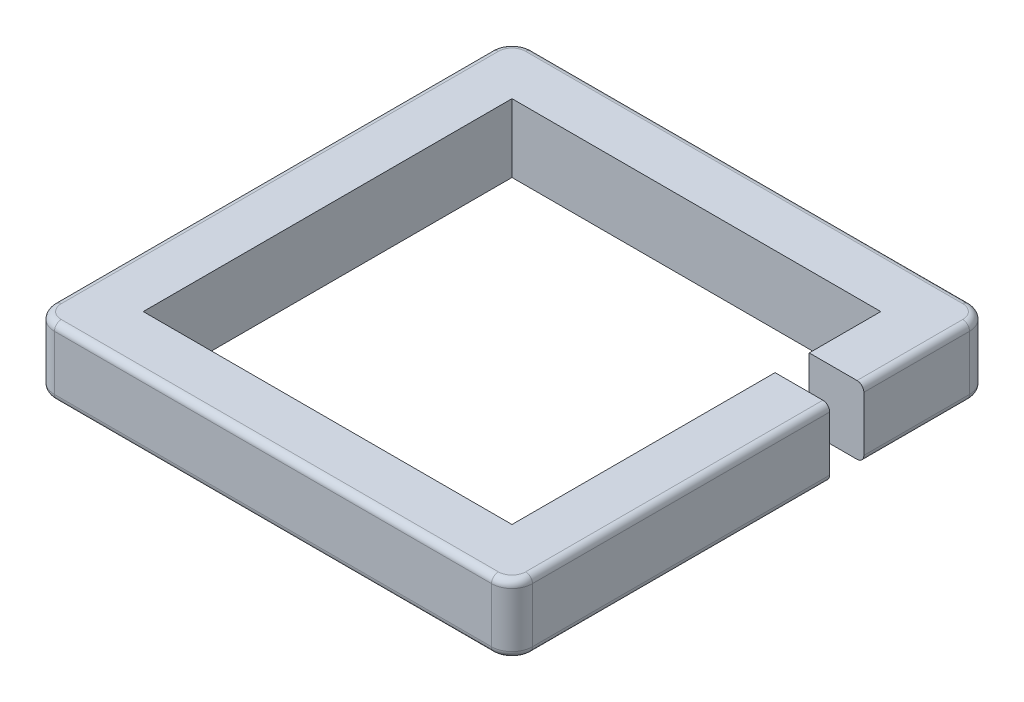
ISO-10303-21;
HEADER;
FILE_DESCRIPTION(('STEP AP214'),'2;1');
FILE_NAME('part.step','',(''),(''),'','','');
FILE_SCHEMA(('AUTOMOTIVE_DESIGN { 1 0 10303 214 1 1 1 1 }'));
ENDSEC;
DATA;
#1=APPLICATION_CONTEXT('core data for automotive mechanical design processes');
#2=APPLICATION_PROTOCOL_DEFINITION('international standard','automotive_design',2000,#1);
#3=PRODUCT_CONTEXT('',#1,'mechanical');
#4=PRODUCT('Part','Part','',(#3));
#5=PRODUCT_RELATED_PRODUCT_CATEGORY('part','',(#4));
#6=PRODUCT_DEFINITION_FORMATION('','',#4);
#7=PRODUCT_DEFINITION_CONTEXT('part definition',#1,'design');
#8=PRODUCT_DEFINITION('design','',#6,#7);
#9=PRODUCT_DEFINITION_SHAPE('','',#8);
#10=(LENGTH_UNIT() NAMED_UNIT(*) SI_UNIT(.MILLI.,.METRE.));
#11=(NAMED_UNIT(*) PLANE_ANGLE_UNIT() SI_UNIT($,.RADIAN.));
#12=(NAMED_UNIT(*) SI_UNIT($,.STERADIAN.) SOLID_ANGLE_UNIT());
#13=UNCERTAINTY_MEASURE_WITH_UNIT(LENGTH_MEASURE(1.E-05),#10,'distance_accuracy_value','');
#14=(GEOMETRIC_REPRESENTATION_CONTEXT(3) GLOBAL_UNCERTAINTY_ASSIGNED_CONTEXT((#13)) GLOBAL_UNIT_ASSIGNED_CONTEXT((#10,
#11,#12)) REPRESENTATION_CONTEXT('',''));
#15=CARTESIAN_POINT('',(0.,0.,0.));
#16=DIRECTION('',(0.,0.,1.));
#17=DIRECTION('',(1.,0.,0.));
#18=AXIS2_PLACEMENT_3D('',#15,#16,#17);
#19=CARTESIAN_POINT('',(444.5,127.,-444.5));
#20=DIRECTION('',(-1.,0.,0.));
#21=DIRECTION('',(0.,0.,1.));
#22=AXIS2_PLACEMENT_3D('',#19,#20,#21);
#23=PLANE('',#22);
#24=DIRECTION('',(0.,0.,-1.));
#25=VECTOR('',#24,1.);
#26=CARTESIAN_POINT('',(444.5,114.3,-444.5));
#27=LINE('',#26,#25);
#28=CARTESIAN_POINT('',(444.5,114.3,-406.4));
#29=VERTEX_POINT('',#28);
#30=CARTESIAN_POINT('',(444.5,114.3,-209.804000000003));
#31=VERTEX_POINT('',#30);
#32=EDGE_CURVE('E361',#29,#31,#27,.F.);
#33=ORIENTED_EDGE('',*,*,#32,.T.);
#34=DIRECTION('',(0.,1.,0.));
#35=VECTOR('',#34,1.);
#36=CARTESIAN_POINT('',(444.5,0.,-209.804000000003));
#37=LINE('',#36,#35);
#38=CARTESIAN_POINT('',(444.5,12.7,-209.804000000003));
#39=VERTEX_POINT('',#38);
#40=EDGE_CURVE('E61',#39,#31,#37,.T.);
#41=ORIENTED_EDGE('',*,*,#40,.F.);
#42=DIRECTION('',(0.,0.,-1.));
#43=VECTOR('',#42,1.);
#44=CARTESIAN_POINT('',(444.5,12.7,-406.4));
#45=LINE('',#44,#43);
#46=CARTESIAN_POINT('',(444.5,12.7,-406.4));
#47=VERTEX_POINT('',#46);
#48=EDGE_CURVE('E364',#39,#47,#45,.T.);
#49=ORIENTED_EDGE('',*,*,#48,.T.);
#50=DIRECTION('',(0.,-1.,0.));
#51=VECTOR('',#50,1.);
#52=CARTESIAN_POINT('',(444.5,127.,-406.4));
#53=LINE('',#52,#51);
#54=EDGE_CURVE('E283',#47,#29,#53,.F.);
#55=ORIENTED_EDGE('',*,*,#54,.T.);
#56=EDGE_LOOP('',(#33,#41,#49,#55));
#57=FACE_BOUND('',#56,.T.);
#58=ADVANCED_FACE('F47',(#57),#23,.F.);
#59=CARTESIAN_POINT('',(342.9,127.,-342.9));
#60=DIRECTION('',(-1.,0.,0.));
#61=DIRECTION('',(0.,0.,1.));
#62=AXIS2_PLACEMENT_3D('',#59,#60,#61);
#63=PLANE('',#62);
#64=DIRECTION('',(0.,1.,0.));
#65=VECTOR('',#64,1.);
#66=CARTESIAN_POINT('',(342.9,0.,-209.804000000003));
#67=LINE('',#66,#65);
#68=CARTESIAN_POINT('',(342.9,0.,-209.804000000003));
#69=VERTEX_POINT('',#68);
#70=CARTESIAN_POINT('',(342.9,127.,-209.804000000003));
#71=VERTEX_POINT('',#70);
#72=EDGE_CURVE('E447',#69,#71,#67,.T.);
#73=ORIENTED_EDGE('',*,*,#72,.T.);
#74=DIRECTION('',(0.,0.,-1.));
#75=VECTOR('',#74,1.);
#76=CARTESIAN_POINT('',(342.9,127.,-342.9));
#77=LINE('',#76,#75);
#78=CARTESIAN_POINT('',(342.9,127.,-342.9));
#79=VERTEX_POINT('',#78);
#80=EDGE_CURVE('E258',#71,#79,#77,.T.);
#81=ORIENTED_EDGE('',*,*,#80,.T.);
#82=DIRECTION('',(0.,-1.,0.));
#83=VECTOR('',#82,1.);
#84=CARTESIAN_POINT('',(342.9,127.,-342.9));
#85=LINE('',#84,#83);
#86=CARTESIAN_POINT('',(342.9,0.,-342.9));
#87=VERTEX_POINT('',#86);
#88=EDGE_CURVE('E265',#79,#87,#85,.T.);
#89=ORIENTED_EDGE('',*,*,#88,.T.);
#90=DIRECTION('',(0.,0.,-1.));
#91=VECTOR('',#90,1.);
#92=CARTESIAN_POINT('',(342.9,0.,-342.9));
#93=LINE('',#92,#91);
#94=EDGE_CURVE('E246',#69,#87,#93,.T.);
#95=ORIENTED_EDGE('',*,*,#94,.F.);
#96=EDGE_LOOP('',(#73,#81,#89,#95));
#97=FACE_BOUND('',#96,.T.);
#98=ADVANCED_FACE('F475',(#97),#63,.T.);
#99=CARTESIAN_POINT('',(431.8,12.7,-444.5));
#100=DIRECTION('',(0.,0.,1.));
#101=DIRECTION('',(1.,0.,0.));
#102=AXIS2_PLACEMENT_3D('',#99,#100,#101);
#103=CYLINDRICAL_SURFACE('',#102,12.7);
#104=CARTESIAN_POINT('',(431.8,12.7,-209.804000000003));
#105=DIRECTION('',(0.,0.,-1.));
#106=DIRECTION('',(-1.,0.,0.));
#107=AXIS2_PLACEMENT_3D('',#104,#105,#106);
#108=CIRCLE('',#107,12.7);
#109=CARTESIAN_POINT('',(431.8,0.,-209.804000000003));
#110=VERTEX_POINT('',#109);
#111=EDGE_CURVE('E393',#110,#39,#108,.F.);
#112=ORIENTED_EDGE('',*,*,#111,.F.);
#113=DIRECTION('',(0.,0.,-1.));
#114=VECTOR('',#113,1.);
#115=CARTESIAN_POINT('',(431.8,0.,406.4));
#116=LINE('',#115,#114);
#117=CARTESIAN_POINT('',(431.8,0.,-406.4));
#118=VERTEX_POINT('',#117);
#119=EDGE_CURVE('E293',#118,#110,#116,.F.);
#120=ORIENTED_EDGE('',*,*,#119,.F.);
#121=CARTESIAN_POINT('',(431.8,12.7,-406.4));
#122=DIRECTION('',(0.,0.,1.));
#123=DIRECTION('',(1.,0.,0.));
#124=AXIS2_PLACEMENT_3D('',#121,#122,#123);
#125=CIRCLE('',#124,12.7);
#126=EDGE_CURVE('E376',#118,#47,#125,.T.);
#127=ORIENTED_EDGE('',*,*,#126,.T.);
#128=ORIENTED_EDGE('',*,*,#48,.F.);
#129=EDGE_LOOP('',(#112,#120,#127,#128));
#130=FACE_BOUND('',#129,.T.);
#131=ADVANCED_FACE('F528',(#130),#103,.T.);
#132=CARTESIAN_POINT('',(431.8,114.3,0.));
#133=DIRECTION('',(0.,0.,-1.));
#134=DIRECTION('',(-1.,0.,0.));
#135=AXIS2_PLACEMENT_3D('',#132,#133,#134);
#136=CYLINDRICAL_SURFACE('',#135,12.7);
#137=CARTESIAN_POINT('',(431.8,114.3,-209.804000000003));
#138=DIRECTION('',(0.,0.,-1.));
#139=DIRECTION('',(-1.,0.,0.));
#140=AXIS2_PLACEMENT_3D('',#137,#138,#139);
#141=CIRCLE('',#140,12.7);
#142=CARTESIAN_POINT('',(431.8,127.,-209.804000000003));
#143=VERTEX_POINT('',#142);
#144=EDGE_CURVE('E11',#31,#143,#141,.F.);
#145=ORIENTED_EDGE('',*,*,#144,.F.);
#146=ORIENTED_EDGE('',*,*,#32,.F.);
#147=CARTESIAN_POINT('',(431.8,114.3,-406.4));
#148=DIRECTION('',(0.,0.,1.));
#149=DIRECTION('',(1.,0.,0.));
#150=AXIS2_PLACEMENT_3D('',#147,#148,#149);
#151=CIRCLE('',#150,12.7);
#152=CARTESIAN_POINT('',(431.8,127.,-406.4));
#153=VERTEX_POINT('',#152);
#154=EDGE_CURVE('E395',#29,#153,#151,.T.);
#155=ORIENTED_EDGE('',*,*,#154,.T.);
#156=DIRECTION('',(0.,0.,-1.));
#157=VECTOR('',#156,1.);
#158=CARTESIAN_POINT('',(431.8,127.,0.));
#159=LINE('',#158,#157);
#160=EDGE_CURVE('E341',#143,#153,#159,.T.);
#161=ORIENTED_EDGE('',*,*,#160,.F.);
#162=EDGE_LOOP('',(#145,#146,#155,#161));
#163=FACE_BOUND('',#162,.T.);
#164=ADVANCED_FACE('F484',(#163),#136,.T.);
#165=CARTESIAN_POINT('',(0.,127.,0.));
#166=DIRECTION('',(0.,-1.,0.));
#167=DIRECTION('',(0.,0.,-1.));
#168=AXIS2_PLACEMENT_3D('',#165,#166,#167);
#169=PLANE('',#168);
#170=ORIENTED_EDGE('',*,*,#80,.F.);
#171=DIRECTION('',(-1.,0.,0.));
#172=VECTOR('',#171,1.);
#173=CARTESIAN_POINT('',(342.9,127.,-209.804000000003));
#174=LINE('',#173,#172);
#175=EDGE_CURVE('E227',#143,#71,#174,.T.);
#176=ORIENTED_EDGE('',*,*,#175,.F.);
#177=ORIENTED_EDGE('',*,*,#160,.T.);
#178=CARTESIAN_POINT('',(406.4,127.,-406.4));
#179=DIRECTION('',(0.,-1.,0.));
#180=DIRECTION('',(0.,0.,-1.));
#181=AXIS2_PLACEMENT_3D('',#178,#179,#180);
#182=CIRCLE('',#181,25.4);
#183=CARTESIAN_POINT('',(406.4,127.,-431.8));
#184=VERTEX_POINT('',#183);
#185=EDGE_CURVE('E345',#153,#184,#182,.F.);
#186=ORIENTED_EDGE('',*,*,#185,.T.);
#187=DIRECTION('',(-1.,0.,0.));
#188=VECTOR('',#187,1.);
#189=CARTESIAN_POINT('',(0.,127.,-431.8));
#190=LINE('',#189,#188);
#191=CARTESIAN_POINT('',(-406.4,127.,-431.8));
#192=VERTEX_POINT('',#191);
#193=EDGE_CURVE('E347',#184,#192,#190,.T.);
#194=ORIENTED_EDGE('',*,*,#193,.T.);
#195=CARTESIAN_POINT('',(-406.4,127.,-406.4));
#196=DIRECTION('',(0.,-1.,0.));
#197=DIRECTION('',(0.,0.,-1.));
#198=AXIS2_PLACEMENT_3D('',#195,#196,#197);
#199=CIRCLE('',#198,25.4);
#200=CARTESIAN_POINT('',(-431.8,127.,-406.4));
#201=VERTEX_POINT('',#200);
#202=EDGE_CURVE('E349',#192,#201,#199,.F.);
#203=ORIENTED_EDGE('',*,*,#202,.T.);
#204=DIRECTION('',(0.,0.,1.));
#205=VECTOR('',#204,1.);
#206=CARTESIAN_POINT('',(-431.8,127.,0.));
#207=LINE('',#206,#205);
#208=CARTESIAN_POINT('',(-431.8,127.,406.4));
#209=VERTEX_POINT('',#208);
#210=EDGE_CURVE('E351',#201,#209,#207,.T.);
#211=ORIENTED_EDGE('',*,*,#210,.T.);
#212=CARTESIAN_POINT('',(-406.4,127.,406.4));
#213=DIRECTION('',(0.,-1.,0.));
#214=DIRECTION('',(0.,0.,-1.));
#215=AXIS2_PLACEMENT_3D('',#212,#213,#214);
#216=CIRCLE('',#215,25.4);
#217=CARTESIAN_POINT('',(-406.4,127.,431.8));
#218=VERTEX_POINT('',#217);
#219=EDGE_CURVE('E353',#209,#218,#216,.F.);
#220=ORIENTED_EDGE('',*,*,#219,.T.);
#221=DIRECTION('',(1.,0.,0.));
#222=VECTOR('',#221,1.);
#223=CARTESIAN_POINT('',(0.,127.,431.8));
#224=LINE('',#223,#222);
#225=CARTESIAN_POINT('',(406.4,127.,431.8));
#226=VERTEX_POINT('',#225);
#227=EDGE_CURVE('E355',#218,#226,#224,.T.);
#228=ORIENTED_EDGE('',*,*,#227,.T.);
#229=CARTESIAN_POINT('',(406.4,127.,406.4));
#230=DIRECTION('',(0.,-1.,0.));
#231=DIRECTION('',(0.,0.,-1.));
#232=AXIS2_PLACEMENT_3D('',#229,#230,#231);
#233=CIRCLE('',#232,25.4);
#234=CARTESIAN_POINT('',(431.8,127.,406.4));
#235=VERTEX_POINT('',#234);
#236=EDGE_CURVE('E357',#226,#235,#233,.F.);
#237=ORIENTED_EDGE('',*,*,#236,.T.);
#238=CARTESIAN_POINT('',(431.8,127.,-146.304000000003));
#239=VERTEX_POINT('',#238);
#240=EDGE_CURVE('E342',#235,#239,#159,.T.);
#241=ORIENTED_EDGE('',*,*,#240,.T.);
#242=DIRECTION('',(1.,0.,0.));
#243=VECTOR('',#242,1.);
#244=CARTESIAN_POINT('',(342.9,127.,-146.304000000003));
#245=LINE('',#244,#243);
#246=CARTESIAN_POINT('',(342.9,127.,-146.304000000003));
#247=VERTEX_POINT('',#246);
#248=EDGE_CURVE('E69',#247,#239,#245,.T.);
#249=ORIENTED_EDGE('',*,*,#248,.F.);
#250=CARTESIAN_POINT('',(342.9,127.,342.9));
#251=VERTEX_POINT('',#250);
#252=EDGE_CURVE('E236',#251,#247,#77,.T.);
#253=ORIENTED_EDGE('',*,*,#252,.F.);
#254=DIRECTION('',(1.,0.,0.));
#255=VECTOR('',#254,1.);
#256=CARTESIAN_POINT('',(-342.9,127.,342.9));
#257=LINE('',#256,#255);
#258=CARTESIAN_POINT('',(-342.9,127.,342.9));
#259=VERTEX_POINT('',#258);
#260=EDGE_CURVE('E253',#259,#251,#257,.T.);
#261=ORIENTED_EDGE('',*,*,#260,.F.);
#262=DIRECTION('',(0.,0.,1.));
#263=VECTOR('',#262,1.);
#264=CARTESIAN_POINT('',(-342.9,127.,-342.9));
#265=LINE('',#264,#263);
#266=CARTESIAN_POINT('',(-342.9,127.,-342.9));
#267=VERTEX_POINT('',#266);
#268=EDGE_CURVE('E455',#267,#259,#265,.T.);
#269=ORIENTED_EDGE('',*,*,#268,.F.);
#270=DIRECTION('',(-1.,0.,0.));
#271=VECTOR('',#270,1.);
#272=CARTESIAN_POINT('',(-342.9,127.,-342.9));
#273=LINE('',#272,#271);
#274=EDGE_CURVE('E454',#79,#267,#273,.T.);
#275=ORIENTED_EDGE('',*,*,#274,.F.);
#276=EDGE_LOOP('',(#170,#176,#177,#186,#194,#203,#211,#220,#228,#237,#241,#249,#253,#261,#269,#275));
#277=FACE_BOUND('',#276,.T.);
#278=ADVANCED_FACE('F465',(#277),#169,.F.);
#279=CARTESIAN_POINT('',(0.,0.,0.));
#280=DIRECTION('',(0.,-1.,0.));
#281=DIRECTION('',(0.,0.,-1.));
#282=AXIS2_PLACEMENT_3D('',#279,#280,#281);
#283=PLANE('',#282);
#284=DIRECTION('',(-1.,0.,0.));
#285=VECTOR('',#284,1.);
#286=CARTESIAN_POINT('',(342.9,0.,-209.804000000003));
#287=LINE('',#286,#285);
#288=EDGE_CURVE('E226',#110,#69,#287,.T.);
#289=ORIENTED_EDGE('',*,*,#288,.T.);
#290=ORIENTED_EDGE('',*,*,#94,.T.);
#291=DIRECTION('',(-1.,0.,0.));
#292=VECTOR('',#291,1.);
#293=CARTESIAN_POINT('',(-342.9,0.,-342.9));
#294=LINE('',#293,#292);
#295=CARTESIAN_POINT('',(-342.9,0.,-342.9));
#296=VERTEX_POINT('',#295);
#297=EDGE_CURVE('E245',#87,#296,#294,.T.);
#298=ORIENTED_EDGE('',*,*,#297,.T.);
#299=DIRECTION('',(0.,0.,1.));
#300=VECTOR('',#299,1.);
#301=CARTESIAN_POINT('',(-342.9,0.,-342.9));
#302=LINE('',#301,#300);
#303=CARTESIAN_POINT('',(-342.9,0.,342.9));
#304=VERTEX_POINT('',#303);
#305=EDGE_CURVE('E249',#296,#304,#302,.T.);
#306=ORIENTED_EDGE('',*,*,#305,.T.);
#307=DIRECTION('',(1.,0.,0.));
#308=VECTOR('',#307,1.);
#309=CARTESIAN_POINT('',(-342.9,0.,342.9));
#310=LINE('',#309,#308);
#311=CARTESIAN_POINT('',(342.9,0.,342.9));
#312=VERTEX_POINT('',#311);
#313=EDGE_CURVE('E244',#304,#312,#310,.T.);
#314=ORIENTED_EDGE('',*,*,#313,.T.);
#315=CARTESIAN_POINT('',(342.9,0.,-146.304000000003));
#316=VERTEX_POINT('',#315);
#317=EDGE_CURVE('E233',#312,#316,#93,.T.);
#318=ORIENTED_EDGE('',*,*,#317,.T.);
#319=DIRECTION('',(1.,0.,0.));
#320=VECTOR('',#319,1.);
#321=CARTESIAN_POINT('',(342.9,0.,-146.304000000003));
#322=LINE('',#321,#320);
#323=CARTESIAN_POINT('',(431.8,0.,-146.304000000003));
#324=VERTEX_POINT('',#323);
#325=EDGE_CURVE('E217',#316,#324,#322,.T.);
#326=ORIENTED_EDGE('',*,*,#325,.T.);
#327=CARTESIAN_POINT('',(431.8,0.,406.4));
#328=VERTEX_POINT('',#327);
#329=EDGE_CURVE('E292',#324,#328,#116,.F.);
#330=ORIENTED_EDGE('',*,*,#329,.T.);
#331=CARTESIAN_POINT('',(406.4,0.,406.4));
#332=DIRECTION('',(0.,-1.,0.));
#333=DIRECTION('',(0.,0.,-1.));
#334=AXIS2_PLACEMENT_3D('',#331,#332,#333);
#335=CIRCLE('',#334,25.4);
#336=CARTESIAN_POINT('',(406.4,0.,431.8));
#337=VERTEX_POINT('',#336);
#338=EDGE_CURVE('E308',#328,#337,#335,.T.);
#339=ORIENTED_EDGE('',*,*,#338,.T.);
#340=DIRECTION('',(1.,0.,0.));
#341=VECTOR('',#340,1.);
#342=CARTESIAN_POINT('',(-406.4,0.,431.8));
#343=LINE('',#342,#341);
#344=CARTESIAN_POINT('',(-406.4,0.,431.8));
#345=VERTEX_POINT('',#344);
#346=EDGE_CURVE('E306',#337,#345,#343,.F.);
#347=ORIENTED_EDGE('',*,*,#346,.T.);
#348=CARTESIAN_POINT('',(-406.4,0.,406.4));
#349=DIRECTION('',(0.,-1.,0.));
#350=DIRECTION('',(0.,0.,-1.));
#351=AXIS2_PLACEMENT_3D('',#348,#349,#350);
#352=CIRCLE('',#351,25.4);
#353=CARTESIAN_POINT('',(-431.8,0.,406.4));
#354=VERTEX_POINT('',#353);
#355=EDGE_CURVE('E304',#345,#354,#352,.T.);
#356=ORIENTED_EDGE('',*,*,#355,.T.);
#357=DIRECTION('',(0.,0.,1.));
#358=VECTOR('',#357,1.);
#359=CARTESIAN_POINT('',(-431.8,0.,-406.4));
#360=LINE('',#359,#358);
#361=CARTESIAN_POINT('',(-431.8,0.,-406.4));
#362=VERTEX_POINT('',#361);
#363=EDGE_CURVE('E302',#354,#362,#360,.F.);
#364=ORIENTED_EDGE('',*,*,#363,.T.);
#365=CARTESIAN_POINT('',(-406.4,0.,-406.4));
#366=DIRECTION('',(0.,-1.,0.));
#367=DIRECTION('',(0.,0.,-1.));
#368=AXIS2_PLACEMENT_3D('',#365,#366,#367);
#369=CIRCLE('',#368,25.4);
#370=CARTESIAN_POINT('',(-406.4,0.,-431.8));
#371=VERTEX_POINT('',#370);
#372=EDGE_CURVE('E300',#362,#371,#369,.T.);
#373=ORIENTED_EDGE('',*,*,#372,.T.);
#374=DIRECTION('',(-1.,0.,0.));
#375=VECTOR('',#374,1.);
#376=CARTESIAN_POINT('',(406.4,0.,-431.8));
#377=LINE('',#376,#375);
#378=CARTESIAN_POINT('',(406.4,0.,-431.8));
#379=VERTEX_POINT('',#378);
#380=EDGE_CURVE('E298',#371,#379,#377,.F.);
#381=ORIENTED_EDGE('',*,*,#380,.T.);
#382=CARTESIAN_POINT('',(406.4,0.,-406.4));
#383=DIRECTION('',(0.,-1.,0.));
#384=DIRECTION('',(0.,0.,-1.));
#385=AXIS2_PLACEMENT_3D('',#382,#383,#384);
#386=CIRCLE('',#385,25.4);
#387=EDGE_CURVE('E296',#379,#118,#386,.T.);
#388=ORIENTED_EDGE('',*,*,#387,.T.);
#389=ORIENTED_EDGE('',*,*,#119,.T.);
#390=EDGE_LOOP('',(#289,#290,#298,#306,#314,#318,#326,#330,#339,#347,#356,#364,#373,#381,#388,#389));
#391=FACE_BOUND('',#390,.T.);
#392=ADVANCED_FACE('F241',(#391),#283,.T.);
#393=CARTESIAN_POINT('',(-444.5,127.,-444.5));
#394=DIRECTION('',(0.,0.,1.));
#395=DIRECTION('',(1.,0.,0.));
#396=AXIS2_PLACEMENT_3D('',#393,#394,#395);
#397=PLANE('',#396);
#398=DIRECTION('',(0.,-1.,0.));
#399=VECTOR('',#398,1.);
#400=CARTESIAN_POINT('',(406.4,127.,-444.5));
#401=LINE('',#400,#399);
#402=CARTESIAN_POINT('',(406.4,114.3,-444.5));
#403=VERTEX_POINT('',#402);
#404=CARTESIAN_POINT('',(406.4,12.7,-444.5));
#405=VERTEX_POINT('',#404);
#406=EDGE_CURVE('E274',#403,#405,#401,.T.);
#407=ORIENTED_EDGE('',*,*,#406,.T.);
#408=DIRECTION('',(-1.,0.,0.));
#409=VECTOR('',#408,1.);
#410=CARTESIAN_POINT('',(-406.4,12.7,-444.5));
#411=LINE('',#410,#409);
#412=CARTESIAN_POINT('',(-406.4,12.7,-444.5));
#413=VERTEX_POINT('',#412);
#414=EDGE_CURVE('E335',#405,#413,#411,.T.);
#415=ORIENTED_EDGE('',*,*,#414,.T.);
#416=DIRECTION('',(0.,-1.,0.));
#417=VECTOR('',#416,1.);
#418=CARTESIAN_POINT('',(-406.4,127.,-444.5));
#419=LINE('',#418,#417);
#420=CARTESIAN_POINT('',(-406.4,114.3,-444.5));
#421=VERTEX_POINT('',#420);
#422=EDGE_CURVE('E277',#413,#421,#419,.F.);
#423=ORIENTED_EDGE('',*,*,#422,.T.);
#424=DIRECTION('',(-1.,0.,0.));
#425=VECTOR('',#424,1.);
#426=CARTESIAN_POINT('',(-444.5,114.3,-444.5));
#427=LINE('',#426,#425);
#428=EDGE_CURVE('E333',#421,#403,#427,.F.);
#429=ORIENTED_EDGE('',*,*,#428,.T.);
#430=EDGE_LOOP('',(#407,#415,#423,#429));
#431=FACE_BOUND('',#430,.T.);
#432=ADVANCED_FACE('F543',(#431),#397,.F.);
#433=CARTESIAN_POINT('',(-444.5,127.,-444.5));
#434=DIRECTION('',(1.,0.,0.));
#435=DIRECTION('',(0.,0.,-1.));
#436=AXIS2_PLACEMENT_3D('',#433,#434,#435);
#437=PLANE('',#436);
#438=DIRECTION('',(0.,-1.,0.));
#439=VECTOR('',#438,1.);
#440=CARTESIAN_POINT('',(-444.5,127.,-406.4));
#441=LINE('',#440,#439);
#442=CARTESIAN_POINT('',(-444.5,114.3,-406.4));
#443=VERTEX_POINT('',#442);
#444=CARTESIAN_POINT('',(-444.5,12.7,-406.4));
#445=VERTEX_POINT('',#444);
#446=EDGE_CURVE('E271',#443,#445,#441,.T.);
#447=ORIENTED_EDGE('',*,*,#446,.T.);
#448=DIRECTION('',(0.,0.,1.));
#449=VECTOR('',#448,1.);
#450=CARTESIAN_POINT('',(-444.5,12.7,406.4));
#451=LINE('',#450,#449);
#452=CARTESIAN_POINT('',(-444.5,12.7,406.4));
#453=VERTEX_POINT('',#452);
#454=EDGE_CURVE('E327',#445,#453,#451,.T.);
#455=ORIENTED_EDGE('',*,*,#454,.T.);
#456=DIRECTION('',(0.,-1.,0.));
#457=VECTOR('',#456,1.);
#458=CARTESIAN_POINT('',(-444.5,127.,406.4));
#459=LINE('',#458,#457);
#460=CARTESIAN_POINT('',(-444.5,114.3,406.4));
#461=VERTEX_POINT('',#460);
#462=EDGE_CURVE('E268',#453,#461,#459,.F.);
#463=ORIENTED_EDGE('',*,*,#462,.T.);
#464=DIRECTION('',(0.,0.,1.));
#465=VECTOR('',#464,1.);
#466=CARTESIAN_POINT('',(-444.5,114.3,-444.5));
#467=LINE('',#466,#465);
#468=EDGE_CURVE('E325',#461,#443,#467,.F.);
#469=ORIENTED_EDGE('',*,*,#468,.T.);
#470=EDGE_LOOP('',(#447,#455,#463,#469));
#471=FACE_BOUND('',#470,.T.);
#472=ADVANCED_FACE('F538',(#471),#437,.F.);
#473=CARTESIAN_POINT('',(-444.5,127.,444.5));
#474=DIRECTION('',(0.,0.,-1.));
#475=DIRECTION('',(-1.,0.,0.));
#476=AXIS2_PLACEMENT_3D('',#473,#474,#475);
#477=PLANE('',#476);
#478=DIRECTION('',(0.,-1.,0.));
#479=VECTOR('',#478,1.);
#480=CARTESIAN_POINT('',(-406.4,127.,444.5));
#481=LINE('',#480,#479);
#482=CARTESIAN_POINT('',(-406.4,114.3,444.5));
#483=VERTEX_POINT('',#482);
#484=CARTESIAN_POINT('',(-406.4,12.7,444.5));
#485=VERTEX_POINT('',#484);
#486=EDGE_CURVE('E286',#483,#485,#481,.T.);
#487=ORIENTED_EDGE('',*,*,#486,.T.);
#488=DIRECTION('',(1.,0.,0.));
#489=VECTOR('',#488,1.);
#490=CARTESIAN_POINT('',(406.4,12.7,444.5));
#491=LINE('',#490,#489);
#492=CARTESIAN_POINT('',(406.4,12.7,444.5));
#493=VERTEX_POINT('',#492);
#494=EDGE_CURVE('E319',#485,#493,#491,.T.);
#495=ORIENTED_EDGE('',*,*,#494,.T.);
#496=DIRECTION('',(0.,-1.,0.));
#497=VECTOR('',#496,1.);
#498=CARTESIAN_POINT('',(406.4,127.,444.5));
#499=LINE('',#498,#497);
#500=CARTESIAN_POINT('',(406.4,114.3,444.5));
#501=VERTEX_POINT('',#500);
#502=EDGE_CURVE('E289',#493,#501,#499,.F.);
#503=ORIENTED_EDGE('',*,*,#502,.T.);
#504=DIRECTION('',(1.,0.,0.));
#505=VECTOR('',#504,1.);
#506=CARTESIAN_POINT('',(-444.5,114.3,444.5));
#507=LINE('',#506,#505);
#508=EDGE_CURVE('E317',#501,#483,#507,.F.);
#509=ORIENTED_EDGE('',*,*,#508,.T.);
#510=EDGE_LOOP('',(#487,#495,#503,#509));
#511=FACE_BOUND('',#510,.T.);
#512=ADVANCED_FACE('F433',(#511),#477,.F.);
#513=CARTESIAN_POINT('',(444.5,12.7,406.4));
#514=VERTEX_POINT('',#513);
#515=CARTESIAN_POINT('',(444.5,12.7,-146.304000000003));
#516=VERTEX_POINT('',#515);
#517=EDGE_CURVE('E365',#514,#516,#45,.T.);
#518=ORIENTED_EDGE('',*,*,#517,.T.);
#519=DIRECTION('',(0.,1.,0.));
#520=VECTOR('',#519,1.);
#521=CARTESIAN_POINT('',(444.5,0.,-146.304000000003));
#522=LINE('',#521,#520);
#523=CARTESIAN_POINT('',(444.5,114.3,-146.304000000003));
#524=VERTEX_POINT('',#523);
#525=EDGE_CURVE('E237',#516,#524,#522,.T.);
#526=ORIENTED_EDGE('',*,*,#525,.T.);
#527=CARTESIAN_POINT('',(444.5,114.3,406.4));
#528=VERTEX_POINT('',#527);
#529=EDGE_CURVE('E360',#524,#528,#27,.F.);
#530=ORIENTED_EDGE('',*,*,#529,.T.);
#531=DIRECTION('',(0.,-1.,0.));
#532=VECTOR('',#531,1.);
#533=CARTESIAN_POINT('',(444.5,127.,406.4));
#534=LINE('',#533,#532);
#535=EDGE_CURVE('E280',#528,#514,#534,.T.);
#536=ORIENTED_EDGE('',*,*,#535,.T.);
#537=EDGE_LOOP('',(#518,#526,#530,#536));
#538=FACE_BOUND('',#537,.T.);
#539=ADVANCED_FACE('F416',(#538),#23,.F.);
#540=DIRECTION('',(0.,1.,0.));
#541=VECTOR('',#540,1.);
#542=CARTESIAN_POINT('',(342.9,0.,-146.304000000003));
#543=LINE('',#542,#541);
#544=EDGE_CURVE('E220',#316,#247,#543,.T.);
#545=ORIENTED_EDGE('',*,*,#544,.F.);
#546=ORIENTED_EDGE('',*,*,#317,.F.);
#547=DIRECTION('',(0.,-1.,0.));
#548=VECTOR('',#547,1.);
#549=CARTESIAN_POINT('',(342.9,127.,342.9));
#550=LINE('',#549,#548);
#551=EDGE_CURVE('E259',#251,#312,#550,.T.);
#552=ORIENTED_EDGE('',*,*,#551,.F.);
#553=ORIENTED_EDGE('',*,*,#252,.T.);
#554=EDGE_LOOP('',(#545,#546,#552,#553));
#555=FACE_BOUND('',#554,.T.);
#556=ADVANCED_FACE('F231',(#555),#63,.T.);
#557=CARTESIAN_POINT('',(-342.9,127.,-342.9));
#558=DIRECTION('',(0.,0.,1.));
#559=DIRECTION('',(1.,0.,0.));
#560=AXIS2_PLACEMENT_3D('',#557,#558,#559);
#561=PLANE('',#560);
#562=ORIENTED_EDGE('',*,*,#297,.F.);
#563=ORIENTED_EDGE('',*,*,#88,.F.);
#564=ORIENTED_EDGE('',*,*,#274,.T.);
#565=DIRECTION('',(0.,-1.,0.));
#566=VECTOR('',#565,1.);
#567=CARTESIAN_POINT('',(-342.9,127.,-342.9));
#568=LINE('',#567,#566);
#569=EDGE_CURVE('E263',#267,#296,#568,.T.);
#570=ORIENTED_EDGE('',*,*,#569,.T.);
#571=EDGE_LOOP('',(#562,#563,#564,#570));
#572=FACE_BOUND('',#571,.T.);
#573=ADVANCED_FACE('F479',(#572),#561,.T.);
#574=CARTESIAN_POINT('',(-342.9,127.,-342.9));
#575=DIRECTION('',(1.,0.,0.));
#576=DIRECTION('',(0.,0.,-1.));
#577=AXIS2_PLACEMENT_3D('',#574,#575,#576);
#578=PLANE('',#577);
#579=ORIENTED_EDGE('',*,*,#305,.F.);
#580=ORIENTED_EDGE('',*,*,#569,.F.);
#581=ORIENTED_EDGE('',*,*,#268,.T.);
#582=DIRECTION('',(0.,-1.,0.));
#583=VECTOR('',#582,1.);
#584=CARTESIAN_POINT('',(-342.9,127.,342.9));
#585=LINE('',#584,#583);
#586=EDGE_CURVE('E261',#259,#304,#585,.T.);
#587=ORIENTED_EDGE('',*,*,#586,.T.);
#588=EDGE_LOOP('',(#579,#580,#581,#587));
#589=FACE_BOUND('',#588,.T.);
#590=ADVANCED_FACE('F601',(#589),#578,.T.);
#591=CARTESIAN_POINT('',(-342.9,127.,342.9));
#592=DIRECTION('',(0.,0.,-1.));
#593=DIRECTION('',(-1.,0.,0.));
#594=AXIS2_PLACEMENT_3D('',#591,#592,#593);
#595=PLANE('',#594);
#596=ORIENTED_EDGE('',*,*,#313,.F.);
#597=ORIENTED_EDGE('',*,*,#586,.F.);
#598=ORIENTED_EDGE('',*,*,#260,.T.);
#599=ORIENTED_EDGE('',*,*,#551,.T.);
#600=EDGE_LOOP('',(#596,#597,#598,#599));
#601=FACE_BOUND('',#600,.T.);
#602=ADVANCED_FACE('F462',(#601),#595,.T.);
#603=CARTESIAN_POINT('',(-406.4,127.,-406.4));
#604=DIRECTION('',(0.,-1.,0.));
#605=DIRECTION('',(0.,0.,-1.));
#606=AXIS2_PLACEMENT_3D('',#603,#604,#605);
#607=CYLINDRICAL_SURFACE('',#606,38.1);
#608=ORIENTED_EDGE('',*,*,#422,.F.);
#609=CARTESIAN_POINT('',(-406.4,12.7,-406.4));
#610=DIRECTION('',(0.,-1.,0.));
#611=DIRECTION('',(0.,0.,-1.));
#612=AXIS2_PLACEMENT_3D('',#609,#610,#611);
#613=CIRCLE('',#612,38.1);
#614=EDGE_CURVE('E331',#413,#445,#613,.F.);
#615=ORIENTED_EDGE('',*,*,#614,.T.);
#616=ORIENTED_EDGE('',*,*,#446,.F.);
#617=CARTESIAN_POINT('',(-406.4,114.3,-406.4));
#618=DIRECTION('',(0.,-1.,0.));
#619=DIRECTION('',(0.,0.,-1.));
#620=AXIS2_PLACEMENT_3D('',#617,#618,#619);
#621=CIRCLE('',#620,38.1);
#622=EDGE_CURVE('E329',#443,#421,#621,.T.);
#623=ORIENTED_EDGE('',*,*,#622,.T.);
#624=EDGE_LOOP('',(#608,#615,#616,#623));
#625=FACE_BOUND('',#624,.T.);
#626=ADVANCED_FACE('F550',(#625),#607,.T.);
#627=CARTESIAN_POINT('',(406.4,127.,-406.4));
#628=DIRECTION('',(0.,-1.,0.));
#629=DIRECTION('',(0.,0.,-1.));
#630=AXIS2_PLACEMENT_3D('',#627,#628,#629);
#631=CYLINDRICAL_SURFACE('',#630,38.1);
#632=ORIENTED_EDGE('',*,*,#54,.F.);
#633=CARTESIAN_POINT('',(406.4,12.7,-406.4));
#634=DIRECTION('',(0.,-1.,0.));
#635=DIRECTION('',(0.,0.,-1.));
#636=AXIS2_PLACEMENT_3D('',#633,#634,#635);
#637=CIRCLE('',#636,38.1);
#638=EDGE_CURVE('E339',#47,#405,#637,.F.);
#639=ORIENTED_EDGE('',*,*,#638,.T.);
#640=ORIENTED_EDGE('',*,*,#406,.F.);
#641=CARTESIAN_POINT('',(406.4,114.3,-406.4));
#642=DIRECTION('',(0.,-1.,0.));
#643=DIRECTION('',(0.,0.,-1.));
#644=AXIS2_PLACEMENT_3D('',#641,#642,#643);
#645=CIRCLE('',#644,38.1);
#646=EDGE_CURVE('E337',#403,#29,#645,.T.);
#647=ORIENTED_EDGE('',*,*,#646,.T.);
#648=EDGE_LOOP('',(#632,#639,#640,#647));
#649=FACE_BOUND('',#648,.T.);
#650=ADVANCED_FACE('F552',(#649),#631,.T.);
#651=CARTESIAN_POINT('',(406.4,127.,406.4));
#652=DIRECTION('',(0.,-1.,0.));
#653=DIRECTION('',(0.,0.,-1.));
#654=AXIS2_PLACEMENT_3D('',#651,#652,#653);
#655=CYLINDRICAL_SURFACE('',#654,38.1);
#656=ORIENTED_EDGE('',*,*,#502,.F.);
#657=CARTESIAN_POINT('',(406.4,12.7,406.4));
#658=DIRECTION('',(0.,-1.,0.));
#659=DIRECTION('',(0.,0.,-1.));
#660=AXIS2_PLACEMENT_3D('',#657,#658,#659);
#661=CIRCLE('',#660,38.1);
#662=EDGE_CURVE('E314',#493,#514,#661,.F.);
#663=ORIENTED_EDGE('',*,*,#662,.T.);
#664=ORIENTED_EDGE('',*,*,#535,.F.);
#665=CARTESIAN_POINT('',(406.4,114.3,406.4));
#666=DIRECTION('',(0.,-1.,0.));
#667=DIRECTION('',(0.,0.,-1.));
#668=AXIS2_PLACEMENT_3D('',#665,#666,#667);
#669=CIRCLE('',#668,38.1);
#670=EDGE_CURVE('E311',#528,#501,#669,.T.);
#671=ORIENTED_EDGE('',*,*,#670,.T.);
#672=EDGE_LOOP('',(#656,#663,#664,#671));
#673=FACE_BOUND('',#672,.T.);
#674=ADVANCED_FACE('F430',(#673),#655,.T.);
#675=CARTESIAN_POINT('',(-406.4,127.,406.4));
#676=DIRECTION('',(0.,-1.,0.));
#677=DIRECTION('',(0.,0.,-1.));
#678=AXIS2_PLACEMENT_3D('',#675,#676,#677);
#679=CYLINDRICAL_SURFACE('',#678,38.1);
#680=ORIENTED_EDGE('',*,*,#462,.F.);
#681=CARTESIAN_POINT('',(-406.4,12.7,406.4));
#682=DIRECTION('',(0.,-1.,0.));
#683=DIRECTION('',(0.,0.,-1.));
#684=AXIS2_PLACEMENT_3D('',#681,#682,#683);
#685=CIRCLE('',#684,38.1);
#686=EDGE_CURVE('E323',#453,#485,#685,.F.);
#687=ORIENTED_EDGE('',*,*,#686,.T.);
#688=ORIENTED_EDGE('',*,*,#486,.F.);
#689=CARTESIAN_POINT('',(-406.4,114.3,406.4));
#690=DIRECTION('',(0.,-1.,0.));
#691=DIRECTION('',(0.,0.,-1.));
#692=AXIS2_PLACEMENT_3D('',#689,#690,#691);
#693=CIRCLE('',#692,38.1);
#694=EDGE_CURVE('E321',#483,#461,#693,.T.);
#695=ORIENTED_EDGE('',*,*,#694,.T.);
#696=EDGE_LOOP('',(#680,#687,#688,#695));
#697=FACE_BOUND('',#696,.T.);
#698=ADVANCED_FACE('F559',(#697),#679,.T.);
#699=CARTESIAN_POINT('',(-406.4,12.7,-406.4));
#700=DIRECTION('',(0.,-1.,0.));
#701=DIRECTION('',(0.,0.,-1.));
#702=AXIS2_PLACEMENT_3D('',#699,#700,#701);
#703=TOROIDAL_SURFACE('',#702,25.4,12.7);
#704=CARTESIAN_POINT('',(-431.8,12.7,-406.4));
#705=DIRECTION('',(0.,0.,1.));
#706=DIRECTION('',(1.,0.,0.));
#707=AXIS2_PLACEMENT_3D('',#704,#705,#706);
#708=CIRCLE('',#707,12.7);
#709=EDGE_CURVE('E385',#445,#362,#708,.T.);
#710=ORIENTED_EDGE('',*,*,#709,.F.);
#711=ORIENTED_EDGE('',*,*,#614,.F.);
#712=CARTESIAN_POINT('',(-406.4,12.7,-431.8));
#713=DIRECTION('',(1.,0.,0.));
#714=DIRECTION('',(0.,0.,-1.));
#715=AXIS2_PLACEMENT_3D('',#712,#713,#714);
#716=CIRCLE('',#715,12.7);
#717=EDGE_CURVE('E251',#371,#413,#716,.T.);
#718=ORIENTED_EDGE('',*,*,#717,.F.);
#719=ORIENTED_EDGE('',*,*,#372,.F.);
#720=EDGE_LOOP('',(#710,#711,#718,#719));
#721=FACE_BOUND('',#720,.T.);
#722=ADVANCED_FACE('F562',(#721),#703,.T.);
#723=CARTESIAN_POINT('',(-444.5,12.7,-431.8));
#724=DIRECTION('',(1.,0.,0.));
#725=DIRECTION('',(0.,0.,-1.));
#726=AXIS2_PLACEMENT_3D('',#723,#724,#725);
#727=CYLINDRICAL_SURFACE('',#726,12.7);
#728=ORIENTED_EDGE('',*,*,#717,.T.);
#729=ORIENTED_EDGE('',*,*,#414,.F.);
#730=CARTESIAN_POINT('',(406.4,12.7,-431.8));
#731=DIRECTION('',(1.,0.,0.));
#732=DIRECTION('',(0.,0.,-1.));
#733=AXIS2_PLACEMENT_3D('',#730,#731,#732);
#734=CIRCLE('',#733,12.7);
#735=EDGE_CURVE('E382',#379,#405,#734,.T.);
#736=ORIENTED_EDGE('',*,*,#735,.F.);
#737=ORIENTED_EDGE('',*,*,#380,.F.);
#738=EDGE_LOOP('',(#728,#729,#736,#737));
#739=FACE_BOUND('',#738,.T.);
#740=ADVANCED_FACE('F581',(#739),#727,.T.);
#741=CARTESIAN_POINT('',(-431.8,12.7,-444.5));
#742=DIRECTION('',(0.,0.,-1.));
#743=DIRECTION('',(-1.,0.,0.));
#744=AXIS2_PLACEMENT_3D('',#741,#742,#743);
#745=CYLINDRICAL_SURFACE('',#744,12.7);
#746=ORIENTED_EDGE('',*,*,#709,.T.);
#747=ORIENTED_EDGE('',*,*,#363,.F.);
#748=CARTESIAN_POINT('',(-431.8,12.7,406.4));
#749=DIRECTION('',(0.,0.,1.));
#750=DIRECTION('',(1.,0.,0.));
#751=AXIS2_PLACEMENT_3D('',#748,#749,#750);
#752=CIRCLE('',#751,12.7);
#753=EDGE_CURVE('E379',#453,#354,#752,.T.);
#754=ORIENTED_EDGE('',*,*,#753,.F.);
#755=ORIENTED_EDGE('',*,*,#454,.F.);
#756=EDGE_LOOP('',(#746,#747,#754,#755));
#757=FACE_BOUND('',#756,.T.);
#758=ADVANCED_FACE('F577',(#757),#745,.T.);
#759=CARTESIAN_POINT('',(406.4,12.7,-406.4));
#760=DIRECTION('',(0.,-1.,0.));
#761=DIRECTION('',(0.,0.,-1.));
#762=AXIS2_PLACEMENT_3D('',#759,#760,#761);
#763=TOROIDAL_SURFACE('',#762,25.4,12.7);
#764=ORIENTED_EDGE('',*,*,#735,.T.);
#765=ORIENTED_EDGE('',*,*,#638,.F.);
#766=ORIENTED_EDGE('',*,*,#126,.F.);
#767=ORIENTED_EDGE('',*,*,#387,.F.);
#768=EDGE_LOOP('',(#764,#765,#766,#767));
#769=FACE_BOUND('',#768,.T.);
#770=ADVANCED_FACE('F573',(#769),#763,.T.);
#771=CARTESIAN_POINT('',(-406.4,12.7,406.4));
#772=DIRECTION('',(0.,-1.,0.));
#773=DIRECTION('',(0.,0.,-1.));
#774=AXIS2_PLACEMENT_3D('',#771,#772,#773);
#775=TOROIDAL_SURFACE('',#774,25.4,12.7);
#776=ORIENTED_EDGE('',*,*,#753,.T.);
#777=ORIENTED_EDGE('',*,*,#355,.F.);
#778=CARTESIAN_POINT('',(-406.4,12.7,431.8));
#779=DIRECTION('',(1.,0.,0.));
#780=DIRECTION('',(0.,0.,-1.));
#781=AXIS2_PLACEMENT_3D('',#778,#779,#780);
#782=CIRCLE('',#781,12.7);
#783=EDGE_CURVE('E373',#485,#345,#782,.T.);
#784=ORIENTED_EDGE('',*,*,#783,.F.);
#785=ORIENTED_EDGE('',*,*,#686,.F.);
#786=EDGE_LOOP('',(#776,#777,#784,#785));
#787=FACE_BOUND('',#786,.T.);
#788=ADVANCED_FACE('F570',(#787),#775,.T.);
#789=CARTESIAN_POINT('',(431.8,12.7,-146.304000000003));
#790=DIRECTION('',(0.,0.,1.));
#791=DIRECTION('',(1.,0.,0.));
#792=AXIS2_PLACEMENT_3D('',#789,#790,#791);
#793=CIRCLE('',#792,12.7);
#794=EDGE_CURVE('E222',#516,#324,#793,.F.);
#795=ORIENTED_EDGE('',*,*,#794,.F.);
#796=ORIENTED_EDGE('',*,*,#517,.F.);
#797=CARTESIAN_POINT('',(431.8,12.7,406.4));
#798=DIRECTION('',(0.,0.,1.));
#799=DIRECTION('',(1.,0.,0.));
#800=AXIS2_PLACEMENT_3D('',#797,#798,#799);
#801=CIRCLE('',#800,12.7);
#802=EDGE_CURVE('E370',#328,#514,#801,.T.);
#803=ORIENTED_EDGE('',*,*,#802,.F.);
#804=ORIENTED_EDGE('',*,*,#329,.F.);
#805=EDGE_LOOP('',(#795,#796,#803,#804));
#806=FACE_BOUND('',#805,.T.);
#807=ADVANCED_FACE('F446',(#806),#103,.T.);
#808=CARTESIAN_POINT('',(-444.5,12.7,431.8));
#809=DIRECTION('',(-1.,0.,0.));
#810=DIRECTION('',(0.,0.,1.));
#811=AXIS2_PLACEMENT_3D('',#808,#809,#810);
#812=CYLINDRICAL_SURFACE('',#811,12.7);
#813=ORIENTED_EDGE('',*,*,#783,.T.);
#814=ORIENTED_EDGE('',*,*,#346,.F.);
#815=CARTESIAN_POINT('',(406.4,12.7,431.8));
#816=DIRECTION('',(1.,0.,0.));
#817=DIRECTION('',(0.,0.,-1.));
#818=AXIS2_PLACEMENT_3D('',#815,#816,#817);
#819=CIRCLE('',#818,12.7);
#820=EDGE_CURVE('E368',#493,#337,#819,.T.);
#821=ORIENTED_EDGE('',*,*,#820,.F.);
#822=ORIENTED_EDGE('',*,*,#494,.F.);
#823=EDGE_LOOP('',(#813,#814,#821,#822));
#824=FACE_BOUND('',#823,.T.);
#825=ADVANCED_FACE('F439',(#824),#812,.T.);
#826=CARTESIAN_POINT('',(406.4,12.7,406.4));
#827=DIRECTION('',(0.,-1.,0.));
#828=DIRECTION('',(0.,0.,-1.));
#829=AXIS2_PLACEMENT_3D('',#826,#827,#828);
#830=TOROIDAL_SURFACE('',#829,25.4,12.7);
#831=ORIENTED_EDGE('',*,*,#802,.T.);
#832=ORIENTED_EDGE('',*,*,#662,.F.);
#833=ORIENTED_EDGE('',*,*,#820,.T.);
#834=ORIENTED_EDGE('',*,*,#338,.F.);
#835=EDGE_LOOP('',(#831,#832,#833,#834));
#836=FACE_BOUND('',#835,.T.);
#837=ADVANCED_FACE('F443',(#836),#830,.T.);
#838=CARTESIAN_POINT('',(-406.4,114.3,-406.4));
#839=DIRECTION('',(0.,-1.,0.));
#840=DIRECTION('',(0.,0.,-1.));
#841=AXIS2_PLACEMENT_3D('',#838,#839,#840);
#842=TOROIDAL_SURFACE('',#841,25.4,12.7);
#843=CARTESIAN_POINT('',(-406.4,114.3,-431.8));
#844=DIRECTION('',(1.,0.,0.));
#845=DIRECTION('',(0.,0.,-1.));
#846=AXIS2_PLACEMENT_3D('',#843,#844,#845);
#847=CIRCLE('',#846,12.7);
#848=EDGE_CURVE('E407',#421,#192,#847,.T.);
#849=ORIENTED_EDGE('',*,*,#848,.F.);
#850=ORIENTED_EDGE('',*,*,#622,.F.);
#851=CARTESIAN_POINT('',(-431.8,114.3,-406.4));
#852=DIRECTION('',(0.,0.,1.));
#853=DIRECTION('',(1.,0.,0.));
#854=AXIS2_PLACEMENT_3D('',#851,#852,#853);
#855=CIRCLE('',#854,12.7);
#856=EDGE_CURVE('E371',#201,#443,#855,.T.);
#857=ORIENTED_EDGE('',*,*,#856,.F.);
#858=ORIENTED_EDGE('',*,*,#202,.F.);
#859=EDGE_LOOP('',(#849,#850,#857,#858));
#860=FACE_BOUND('',#859,.T.);
#861=ADVANCED_FACE('F49',(#860),#842,.T.);
#862=CARTESIAN_POINT('',(-431.8,114.3,0.));
#863=DIRECTION('',(0.,0.,1.));
#864=DIRECTION('',(1.,0.,0.));
#865=AXIS2_PLACEMENT_3D('',#862,#863,#864);
#866=CYLINDRICAL_SURFACE('',#865,12.7);
#867=ORIENTED_EDGE('',*,*,#856,.T.);
#868=ORIENTED_EDGE('',*,*,#468,.F.);
#869=CARTESIAN_POINT('',(-431.8,114.3,406.4));
#870=DIRECTION('',(0.,0.,1.));
#871=DIRECTION('',(1.,0.,0.));
#872=AXIS2_PLACEMENT_3D('',#869,#870,#871);
#873=CIRCLE('',#872,12.7);
#874=EDGE_CURVE('E404',#209,#461,#873,.T.);
#875=ORIENTED_EDGE('',*,*,#874,.F.);
#876=ORIENTED_EDGE('',*,*,#210,.F.);
#877=EDGE_LOOP('',(#867,#868,#875,#876));
#878=FACE_BOUND('',#877,.T.);
#879=ADVANCED_FACE('F506',(#878),#866,.T.);
#880=CARTESIAN_POINT('',(0.,114.3,-431.8));
#881=DIRECTION('',(-1.,0.,0.));
#882=DIRECTION('',(0.,0.,1.));
#883=AXIS2_PLACEMENT_3D('',#880,#881,#882);
#884=CYLINDRICAL_SURFACE('',#883,12.7);
#885=ORIENTED_EDGE('',*,*,#848,.T.);
#886=ORIENTED_EDGE('',*,*,#193,.F.);
#887=CARTESIAN_POINT('',(406.4,114.3,-431.8));
#888=DIRECTION('',(1.,0.,0.));
#889=DIRECTION('',(0.,0.,-1.));
#890=AXIS2_PLACEMENT_3D('',#887,#888,#889);
#891=CIRCLE('',#890,12.7);
#892=EDGE_CURVE('E401',#403,#184,#891,.T.);
#893=ORIENTED_EDGE('',*,*,#892,.F.);
#894=ORIENTED_EDGE('',*,*,#428,.F.);
#895=EDGE_LOOP('',(#885,#886,#893,#894));
#896=FACE_BOUND('',#895,.T.);
#897=ADVANCED_FACE('F494',(#896),#884,.T.);
#898=CARTESIAN_POINT('',(-406.4,114.3,406.4));
#899=DIRECTION('',(0.,-1.,0.));
#900=DIRECTION('',(0.,0.,-1.));
#901=AXIS2_PLACEMENT_3D('',#898,#899,#900);
#902=TOROIDAL_SURFACE('',#901,25.4,12.7);
#903=ORIENTED_EDGE('',*,*,#874,.T.);
#904=ORIENTED_EDGE('',*,*,#694,.F.);
#905=CARTESIAN_POINT('',(-406.4,114.3,431.8));
#906=DIRECTION('',(1.,0.,0.));
#907=DIRECTION('',(0.,0.,-1.));
#908=AXIS2_PLACEMENT_3D('',#905,#906,#907);
#909=CIRCLE('',#908,12.7);
#910=EDGE_CURVE('E398',#218,#483,#909,.T.);
#911=ORIENTED_EDGE('',*,*,#910,.F.);
#912=ORIENTED_EDGE('',*,*,#219,.F.);
#913=EDGE_LOOP('',(#903,#904,#911,#912));
#914=FACE_BOUND('',#913,.T.);
#915=ADVANCED_FACE('F509',(#914),#902,.T.);
#916=CARTESIAN_POINT('',(406.4,114.3,-406.4));
#917=DIRECTION('',(0.,-1.,0.));
#918=DIRECTION('',(0.,0.,-1.));
#919=AXIS2_PLACEMENT_3D('',#916,#917,#918);
#920=TOROIDAL_SURFACE('',#919,25.4,12.7);
#921=ORIENTED_EDGE('',*,*,#892,.T.);
#922=ORIENTED_EDGE('',*,*,#185,.F.);
#923=ORIENTED_EDGE('',*,*,#154,.F.);
#924=ORIENTED_EDGE('',*,*,#646,.F.);
#925=EDGE_LOOP('',(#921,#922,#923,#924));
#926=FACE_BOUND('',#925,.T.);
#927=ADVANCED_FACE('F489',(#926),#920,.T.);
#928=CARTESIAN_POINT('',(0.,114.3,431.8));
#929=DIRECTION('',(1.,0.,0.));
#930=DIRECTION('',(0.,0.,-1.));
#931=AXIS2_PLACEMENT_3D('',#928,#929,#930);
#932=CYLINDRICAL_SURFACE('',#931,12.7);
#933=ORIENTED_EDGE('',*,*,#910,.T.);
#934=ORIENTED_EDGE('',*,*,#508,.F.);
#935=CARTESIAN_POINT('',(406.4,114.3,431.8));
#936=DIRECTION('',(1.,0.,0.));
#937=DIRECTION('',(0.,0.,-1.));
#938=AXIS2_PLACEMENT_3D('',#935,#936,#937);
#939=CIRCLE('',#938,12.7);
#940=EDGE_CURVE('E392',#226,#501,#939,.T.);
#941=ORIENTED_EDGE('',*,*,#940,.F.);
#942=ORIENTED_EDGE('',*,*,#227,.F.);
#943=EDGE_LOOP('',(#933,#934,#941,#942));
#944=FACE_BOUND('',#943,.T.);
#945=ADVANCED_FACE('F512',(#944),#932,.T.);
#946=CARTESIAN_POINT('',(431.8,114.3,-146.304000000003));
#947=DIRECTION('',(0.,0.,1.));
#948=DIRECTION('',(1.,0.,0.));
#949=AXIS2_PLACEMENT_3D('',#946,#947,#948);
#950=CIRCLE('',#949,12.7);
#951=EDGE_CURVE('E55',#239,#524,#950,.F.);
#952=ORIENTED_EDGE('',*,*,#951,.F.);
#953=ORIENTED_EDGE('',*,*,#240,.F.);
#954=CARTESIAN_POINT('',(431.8,114.3,406.4));
#955=DIRECTION('',(0.,0.,1.));
#956=DIRECTION('',(1.,0.,0.));
#957=AXIS2_PLACEMENT_3D('',#954,#955,#956);
#958=CIRCLE('',#957,12.7);
#959=EDGE_CURVE('E390',#528,#235,#958,.T.);
#960=ORIENTED_EDGE('',*,*,#959,.F.);
#961=ORIENTED_EDGE('',*,*,#529,.F.);
#962=EDGE_LOOP('',(#952,#953,#960,#961));
#963=FACE_BOUND('',#962,.T.);
#964=ADVANCED_FACE('F421',(#963),#136,.T.);
#965=CARTESIAN_POINT('',(406.4,114.3,406.4));
#966=DIRECTION('',(0.,-1.,0.));
#967=DIRECTION('',(0.,0.,-1.));
#968=AXIS2_PLACEMENT_3D('',#965,#966,#967);
#969=TOROIDAL_SURFACE('',#968,25.4,12.7);
#970=ORIENTED_EDGE('',*,*,#940,.T.);
#971=ORIENTED_EDGE('',*,*,#670,.F.);
#972=ORIENTED_EDGE('',*,*,#959,.T.);
#973=ORIENTED_EDGE('',*,*,#236,.F.);
#974=EDGE_LOOP('',(#970,#971,#972,#973));
#975=FACE_BOUND('',#974,.T.);
#976=ADVANCED_FACE('F425',(#975),#969,.T.);
#977=CARTESIAN_POINT('',(342.9,0.,-146.304000000003));
#978=DIRECTION('',(0.,0.,1.));
#979=DIRECTION('',(1.,0.,0.));
#980=AXIS2_PLACEMENT_3D('',#977,#978,#979);
#981=PLANE('',#980);
#982=ORIENTED_EDGE('',*,*,#794,.T.);
#983=ORIENTED_EDGE('',*,*,#325,.F.);
#984=ORIENTED_EDGE('',*,*,#544,.T.);
#985=ORIENTED_EDGE('',*,*,#248,.T.);
#986=ORIENTED_EDGE('',*,*,#951,.T.);
#987=ORIENTED_EDGE('',*,*,#525,.F.);
#988=EDGE_LOOP('',(#982,#983,#984,#985,#986,#987));
#989=FACE_BOUND('',#988,.T.);
#990=ADVANCED_FACE('F219',(#989),#981,.F.);
#991=CARTESIAN_POINT('',(342.9,0.,-209.804000000003));
#992=DIRECTION('',(0.,0.,-1.));
#993=DIRECTION('',(-1.,0.,0.));
#994=AXIS2_PLACEMENT_3D('',#991,#992,#993);
#995=PLANE('',#994);
#996=ORIENTED_EDGE('',*,*,#111,.T.);
#997=ORIENTED_EDGE('',*,*,#40,.T.);
#998=ORIENTED_EDGE('',*,*,#144,.T.);
#999=ORIENTED_EDGE('',*,*,#175,.T.);
#1000=ORIENTED_EDGE('',*,*,#72,.F.);
#1001=ORIENTED_EDGE('',*,*,#288,.F.);
#1002=EDGE_LOOP('',(#996,#997,#998,#999,#1000,#1001));
#1003=FACE_BOUND('',#1002,.T.);
#1004=ADVANCED_FACE('F592',(#1003),#995,.F.);
#1005=CLOSED_SHELL('',(#58,#98,#131,#164,#278,#392,#432,#472,#512,#539,#556,#573,#590,#602,#626,
#650,#674,#698,#722,#740,#758,#770,#788,#807,#825,#837,#861,#879,#897,#915,#927,#945,#964,#976,
#990,#1004));
#1006=MANIFOLD_SOLID_BREP('B2',#1005);
#1007=ADVANCED_BREP_SHAPE_REPRESENTATION('',(#18,#1006),#14);
#1008=SHAPE_DEFINITION_REPRESENTATION(#9,#1007);
ENDSEC;
END-ISO-10303-21;
